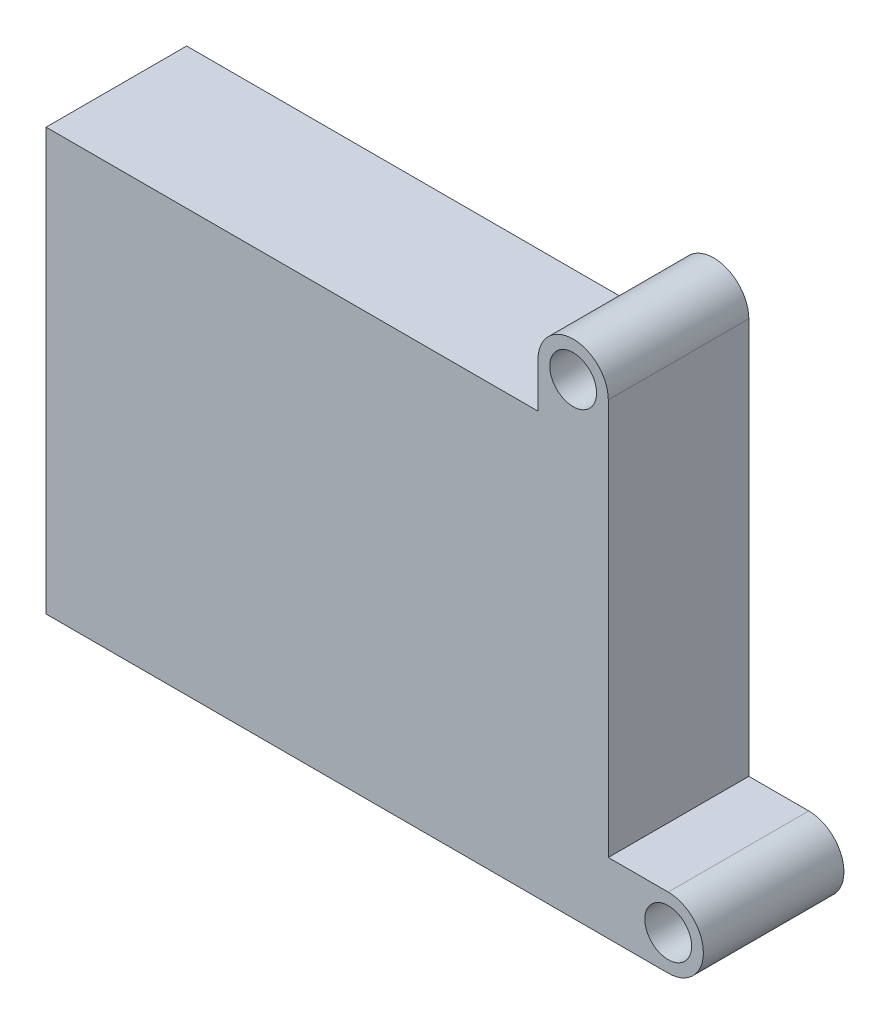
ISO-10303-21;
HEADER;
FILE_DESCRIPTION(('STEP AP214'),'2;1');
FILE_NAME('part.step','',(''),(''),'','','');
FILE_SCHEMA(('AUTOMOTIVE_DESIGN { 1 0 10303 214 1 1 1 1 }'));
ENDSEC;
DATA;
#1=APPLICATION_CONTEXT('core data for automotive mechanical design processes');
#2=APPLICATION_PROTOCOL_DEFINITION('international standard','automotive_design',2000,#1);
#3=PRODUCT_CONTEXT('',#1,'mechanical');
#4=PRODUCT('Part','Part','',(#3));
#5=PRODUCT_RELATED_PRODUCT_CATEGORY('part','',(#4));
#6=PRODUCT_DEFINITION_FORMATION('','',#4);
#7=PRODUCT_DEFINITION_CONTEXT('part definition',#1,'design');
#8=PRODUCT_DEFINITION('design','',#6,#7);
#9=PRODUCT_DEFINITION_SHAPE('','',#8);
#10=(LENGTH_UNIT() NAMED_UNIT(*) SI_UNIT(.MILLI.,.METRE.));
#11=(NAMED_UNIT(*) PLANE_ANGLE_UNIT() SI_UNIT($,.RADIAN.));
#12=(NAMED_UNIT(*) SI_UNIT($,.STERADIAN.) SOLID_ANGLE_UNIT());
#13=UNCERTAINTY_MEASURE_WITH_UNIT(LENGTH_MEASURE(1.E-05),#10,'distance_accuracy_value','');
#14=(GEOMETRIC_REPRESENTATION_CONTEXT(3) GLOBAL_UNCERTAINTY_ASSIGNED_CONTEXT((#13)) GLOBAL_UNIT_ASSIGNED_CONTEXT((#10,
#11,#12)) REPRESENTATION_CONTEXT('',''));
#15=CARTESIAN_POINT('',(0.,0.,0.));
#16=DIRECTION('',(0.,0.,1.));
#17=DIRECTION('',(1.,0.,0.));
#18=AXIS2_PLACEMENT_3D('',#15,#16,#17);
#19=CARTESIAN_POINT('',(1067.89400793056,99.4807815158164,0.));
#20=DIRECTION('',(0.,0.,1.));
#21=DIRECTION('',(-1.,0.,0.));
#22=AXIS2_PLACEMENT_3D('',#19,#20,#21);
#23=CYLINDRICAL_SURFACE('',#22,25.4);
#24=CARTESIAN_POINT('',(1067.89400793056,99.4807815158164,152.4));
#25=DIRECTION('',(0.,0.,-1.));
#26=DIRECTION('',(-1.,0.,0.));
#27=AXIS2_PLACEMENT_3D('',#24,#25,#26);
#28=CIRCLE('',#27,25.4);
#29=CARTESIAN_POINT('',(1093.29400793056,99.4807815158164,152.4));
#30=VERTEX_POINT('',#29);
#31=EDGE_CURVE('E34',#30,#30,#28,.T.);
#32=ORIENTED_EDGE('',*,*,#31,.F.);
#33=EDGE_LOOP('',(#32));
#34=FACE_BOUND('',#33,.T.);
#35=CARTESIAN_POINT('',(1067.89400793056,99.4807815158164,0.));
#36=DIRECTION('',(0.,0.,1.));
#37=DIRECTION('',(-1.,0.,0.));
#38=AXIS2_PLACEMENT_3D('',#35,#36,#37);
#39=CIRCLE('',#38,25.4);
#40=CARTESIAN_POINT('',(1093.29400793056,99.4807815158164,0.));
#41=VERTEX_POINT('',#40);
#42=EDGE_CURVE('E114',#41,#41,#39,.T.);
#43=ORIENTED_EDGE('',*,*,#42,.F.);
#44=EDGE_LOOP('',(#43));
#45=FACE_BOUND('',#44,.T.);
#46=ADVANCED_FACE('F17',(#34,#45),#23,.F.);
#47=CARTESIAN_POINT('',(1170.97600246837,-368.3,0.));
#48=DIRECTION('',(0.,0.,1.));
#49=DIRECTION('',(-1.,0.,0.));
#50=AXIS2_PLACEMENT_3D('',#47,#48,#49);
#51=CYLINDRICAL_SURFACE('',#50,25.4);
#52=CARTESIAN_POINT('',(1170.97600246837,-368.3,152.4));
#53=DIRECTION('',(0.,0.,-1.));
#54=DIRECTION('',(-1.,0.,0.));
#55=AXIS2_PLACEMENT_3D('',#52,#53,#54);
#56=CIRCLE('',#55,25.4);
#57=CARTESIAN_POINT('',(1196.37600246837,-368.3,152.4));
#58=VERTEX_POINT('',#57);
#59=EDGE_CURVE('E359',#58,#58,#56,.T.);
#60=ORIENTED_EDGE('',*,*,#59,.F.);
#61=EDGE_LOOP('',(#60));
#62=FACE_BOUND('',#61,.T.);
#63=CARTESIAN_POINT('',(1170.97600246837,-368.3,0.));
#64=DIRECTION('',(0.,0.,1.));
#65=DIRECTION('',(-1.,0.,0.));
#66=AXIS2_PLACEMENT_3D('',#63,#64,#65);
#67=CIRCLE('',#66,25.4);
#68=CARTESIAN_POINT('',(1196.37600246837,-368.3,0.));
#69=VERTEX_POINT('',#68);
#70=EDGE_CURVE('E111',#69,#69,#67,.T.);
#71=ORIENTED_EDGE('',*,*,#70,.F.);
#72=EDGE_LOOP('',(#71));
#73=FACE_BOUND('',#72,.T.);
#74=ADVANCED_FACE('F194',(#62,#73),#51,.F.);
#75=CARTESIAN_POINT('',(1029.79400793056,50.8,0.));
#76=DIRECTION('',(-1.,0.,0.));
#77=DIRECTION('',(0.,0.707106781186548,0.707106781186548));
#78=AXIS2_PLACEMENT_3D('',#75,#76,#77);
#79=PLANE('',#78);
#80=DIRECTION('',(0.,1.,0.));
#81=VECTOR('',#80,1.);
#82=CARTESIAN_POINT('',(1029.79400793056,50.8,152.4));
#83=LINE('',#82,#81);
#84=CARTESIAN_POINT('',(1029.79400793056,50.8,152.4));
#85=VERTEX_POINT('',#84);
#86=CARTESIAN_POINT('',(1029.79400793056,99.4807815158164,152.4));
#87=VERTEX_POINT('',#86);
#88=EDGE_CURVE('E11',#85,#87,#83,.T.);
#89=ORIENTED_EDGE('',*,*,#88,.T.);
#90=DIRECTION('',(0.,0.,1.));
#91=VECTOR('',#90,1.);
#92=CARTESIAN_POINT('',(1029.79400793056,99.4807815158164,0.));
#93=LINE('',#92,#91);
#94=CARTESIAN_POINT('',(1029.79400793056,99.4807815158164,0.));
#95=VERTEX_POINT('',#94);
#96=EDGE_CURVE('E123',#95,#87,#93,.T.);
#97=ORIENTED_EDGE('',*,*,#96,.F.);
#98=DIRECTION('',(0.,1.,0.));
#99=VECTOR('',#98,1.);
#100=CARTESIAN_POINT('',(1029.79400793056,50.8,0.));
#101=LINE('',#100,#99);
#102=CARTESIAN_POINT('',(1029.79400793056,50.8,0.));
#103=VERTEX_POINT('',#102);
#104=EDGE_CURVE('E112',#103,#95,#101,.T.);
#105=ORIENTED_EDGE('',*,*,#104,.F.);
#106=DIRECTION('',(0.,0.,1.));
#107=VECTOR('',#106,1.);
#108=CARTESIAN_POINT('',(1029.79400793056,50.8,0.));
#109=LINE('',#108,#107);
#110=EDGE_CURVE('E27',#103,#85,#109,.T.);
#111=ORIENTED_EDGE('',*,*,#110,.T.);
#112=EDGE_LOOP('',(#89,#97,#105,#111));
#113=FACE_BOUND('',#112,.T.);
#114=ADVANCED_FACE('F163',(#113),#79,.T.);
#115=CARTESIAN_POINT('',(1067.89400793056,99.4807815158164,0.));
#116=DIRECTION('',(0.,0.,1.));
#117=DIRECTION('',(-1.,0.,0.));
#118=AXIS2_PLACEMENT_3D('',#115,#116,#117);
#119=CYLINDRICAL_SURFACE('',#118,38.1);
#120=CARTESIAN_POINT('',(1067.89400793056,99.4807815158164,152.4));
#121=DIRECTION('',(0.,0.,-1.));
#122=DIRECTION('',(-1.,0.,0.));
#123=AXIS2_PLACEMENT_3D('',#120,#121,#122);
#124=CIRCLE('',#123,38.1);
#125=CARTESIAN_POINT('',(1105.99400793056,99.4807815158164,152.4));
#126=VERTEX_POINT('',#125);
#127=EDGE_CURVE('E125',#87,#126,#124,.T.);
#128=ORIENTED_EDGE('',*,*,#127,.T.);
#129=DIRECTION('',(0.,0.,1.));
#130=VECTOR('',#129,1.);
#131=CARTESIAN_POINT('',(1105.99400793056,99.4807815158164,0.));
#132=LINE('',#131,#130);
#133=CARTESIAN_POINT('',(1105.99400793056,99.4807815158164,0.));
#134=VERTEX_POINT('',#133);
#135=EDGE_CURVE('E128',#134,#126,#132,.T.);
#136=ORIENTED_EDGE('',*,*,#135,.F.);
#137=CARTESIAN_POINT('',(1067.89400793056,99.4807815158164,0.));
#138=DIRECTION('',(0.,0.,-1.));
#139=DIRECTION('',(-1.,0.,0.));
#140=AXIS2_PLACEMENT_3D('',#137,#138,#139);
#141=CIRCLE('',#140,38.1);
#142=EDGE_CURVE('E116',#95,#134,#141,.T.);
#143=ORIENTED_EDGE('',*,*,#142,.F.);
#144=ORIENTED_EDGE('',*,*,#96,.T.);
#145=EDGE_LOOP('',(#128,#136,#143,#144));
#146=FACE_BOUND('',#145,.T.);
#147=ADVANCED_FACE('F167',(#146),#119,.T.);
#148=CARTESIAN_POINT('',(1105.99400793056,50.8,0.));
#149=DIRECTION('',(1.,0.,0.));
#150=DIRECTION('',(0.,0.707106781186548,0.707106781186548));
#151=AXIS2_PLACEMENT_3D('',#148,#149,#150);
#152=PLANE('',#151);
#153=DIRECTION('',(0.,-1.,0.));
#154=VECTOR('',#153,1.);
#155=CARTESIAN_POINT('',(1105.99400793056,50.8,152.4));
#156=LINE('',#155,#154);
#157=CARTESIAN_POINT('',(1105.99400793056,-330.2,152.4));
#158=VERTEX_POINT('',#157);
#159=EDGE_CURVE('E129',#126,#158,#156,.T.);
#160=ORIENTED_EDGE('',*,*,#159,.T.);
#161=DIRECTION('',(0.,0.,1.));
#162=VECTOR('',#161,1.);
#163=CARTESIAN_POINT('',(1105.99400793056,-330.2,0.));
#164=LINE('',#163,#162);
#165=CARTESIAN_POINT('',(1105.99400793056,-330.2,0.));
#166=VERTEX_POINT('',#165);
#167=EDGE_CURVE('E134',#166,#158,#164,.T.);
#168=ORIENTED_EDGE('',*,*,#167,.F.);
#169=DIRECTION('',(0.,-1.,0.));
#170=VECTOR('',#169,1.);
#171=CARTESIAN_POINT('',(1105.99400793056,99.4807815158164,0.));
#172=LINE('',#171,#170);
#173=EDGE_CURVE('E119',#134,#166,#172,.T.);
#174=ORIENTED_EDGE('',*,*,#173,.F.);
#175=ORIENTED_EDGE('',*,*,#135,.T.);
#176=EDGE_LOOP('',(#160,#168,#174,#175));
#177=FACE_BOUND('',#176,.T.);
#178=ADVANCED_FACE('F173',(#177),#152,.T.);
#179=CARTESIAN_POINT('',(1105.99400793056,-330.2,0.));
#180=DIRECTION('',(0.,1.,0.));
#181=DIRECTION('',(0.707106781186548,0.,0.707106781186548));
#182=AXIS2_PLACEMENT_3D('',#179,#180,#181);
#183=PLANE('',#182);
#184=DIRECTION('',(1.,0.,0.));
#185=VECTOR('',#184,1.);
#186=CARTESIAN_POINT('',(1105.99400793056,-330.2,152.4));
#187=LINE('',#186,#185);
#188=CARTESIAN_POINT('',(1170.97600246837,-330.2,152.4));
#189=VERTEX_POINT('',#188);
#190=EDGE_CURVE('E130',#158,#189,#187,.T.);
#191=ORIENTED_EDGE('',*,*,#190,.T.);
#192=DIRECTION('',(0.,0.,1.));
#193=VECTOR('',#192,1.);
#194=CARTESIAN_POINT('',(1170.97600246837,-330.2,0.));
#195=LINE('',#194,#193);
#196=CARTESIAN_POINT('',(1170.97600246837,-330.2,0.));
#197=VERTEX_POINT('',#196);
#198=EDGE_CURVE('E141',#197,#189,#195,.T.);
#199=ORIENTED_EDGE('',*,*,#198,.F.);
#200=DIRECTION('',(1.,0.,0.));
#201=VECTOR('',#200,1.);
#202=CARTESIAN_POINT('',(1105.99400793056,-330.2,0.));
#203=LINE('',#202,#201);
#204=EDGE_CURVE('E138',#166,#197,#203,.T.);
#205=ORIENTED_EDGE('',*,*,#204,.F.);
#206=ORIENTED_EDGE('',*,*,#167,.T.);
#207=EDGE_LOOP('',(#191,#199,#205,#206));
#208=FACE_BOUND('',#207,.T.);
#209=ADVANCED_FACE('F176',(#208),#183,.T.);
#210=CARTESIAN_POINT('',(1170.97600246837,-368.3,0.));
#211=DIRECTION('',(0.,0.,1.));
#212=DIRECTION('',(0.,1.,0.));
#213=AXIS2_PLACEMENT_3D('',#210,#211,#212);
#214=CYLINDRICAL_SURFACE('',#213,38.1);
#215=CARTESIAN_POINT('',(1170.97600246837,-368.3,152.4));
#216=DIRECTION('',(0.,0.,-1.));
#217=DIRECTION('',(0.,1.,0.));
#218=AXIS2_PLACEMENT_3D('',#215,#216,#217);
#219=CIRCLE('',#218,38.1);
#220=CARTESIAN_POINT('',(1170.97600246837,-406.4,152.4));
#221=VERTEX_POINT('',#220);
#222=EDGE_CURVE('E136',#189,#221,#219,.T.);
#223=ORIENTED_EDGE('',*,*,#222,.T.);
#224=DIRECTION('',(0.,0.,1.));
#225=VECTOR('',#224,1.);
#226=CARTESIAN_POINT('',(1170.97600246837,-406.4,0.));
#227=LINE('',#226,#225);
#228=CARTESIAN_POINT('',(1170.97600246837,-406.4,0.));
#229=VERTEX_POINT('',#228);
#230=EDGE_CURVE('E148',#229,#221,#227,.T.);
#231=ORIENTED_EDGE('',*,*,#230,.F.);
#232=CARTESIAN_POINT('',(1170.97600246837,-368.3,0.));
#233=DIRECTION('',(0.,0.,-1.));
#234=DIRECTION('',(0.,1.,0.));
#235=AXIS2_PLACEMENT_3D('',#232,#233,#234);
#236=CIRCLE('',#235,38.1);
#237=EDGE_CURVE('E145',#197,#229,#236,.T.);
#238=ORIENTED_EDGE('',*,*,#237,.F.);
#239=ORIENTED_EDGE('',*,*,#198,.T.);
#240=EDGE_LOOP('',(#223,#231,#238,#239));
#241=FACE_BOUND('',#240,.T.);
#242=ADVANCED_FACE('F181',(#241),#214,.T.);
#243=CARTESIAN_POINT('',(1105.99400793056,-406.4,0.));
#244=DIRECTION('',(0.,-1.,0.));
#245=DIRECTION('',(0.707106781186548,0.,0.707106781186548));
#246=AXIS2_PLACEMENT_3D('',#243,#244,#245);
#247=PLANE('',#246);
#248=DIRECTION('',(-1.,0.,0.));
#249=VECTOR('',#248,1.);
#250=CARTESIAN_POINT('',(1105.99400793056,-406.4,152.4));
#251=LINE('',#250,#249);
#252=CARTESIAN_POINT('',(496.394007930558,-406.4,152.4));
#253=VERTEX_POINT('',#252);
#254=EDGE_CURVE('E143',#221,#253,#251,.T.);
#255=ORIENTED_EDGE('',*,*,#254,.T.);
#256=DIRECTION('',(0.,0.,1.));
#257=VECTOR('',#256,1.);
#258=CARTESIAN_POINT('',(496.394007930558,-406.4,0.));
#259=LINE('',#258,#257);
#260=CARTESIAN_POINT('',(496.394007930558,-406.4,0.));
#261=VERTEX_POINT('',#260);
#262=EDGE_CURVE('E153',#261,#253,#259,.T.);
#263=ORIENTED_EDGE('',*,*,#262,.F.);
#264=DIRECTION('',(-1.,0.,0.));
#265=VECTOR('',#264,1.);
#266=CARTESIAN_POINT('',(1170.97600246837,-406.4,0.));
#267=LINE('',#266,#265);
#268=EDGE_CURVE('E99',#229,#261,#267,.T.);
#269=ORIENTED_EDGE('',*,*,#268,.F.);
#270=ORIENTED_EDGE('',*,*,#230,.T.);
#271=EDGE_LOOP('',(#255,#263,#269,#270));
#272=FACE_BOUND('',#271,.T.);
#273=ADVANCED_FACE('F183',(#272),#247,.T.);
#274=CARTESIAN_POINT('',(496.394007930558,-406.4,0.));
#275=DIRECTION('',(-1.,0.,0.));
#276=DIRECTION('',(0.,0.707106781186548,0.707106781186548));
#277=AXIS2_PLACEMENT_3D('',#274,#275,#276);
#278=PLANE('',#277);
#279=DIRECTION('',(0.,1.,0.));
#280=VECTOR('',#279,1.);
#281=CARTESIAN_POINT('',(496.394007930558,-406.4,152.4));
#282=LINE('',#281,#280);
#283=CARTESIAN_POINT('',(496.394007930558,50.8,152.4));
#284=VERTEX_POINT('',#283);
#285=EDGE_CURVE('E105',#253,#284,#282,.T.);
#286=ORIENTED_EDGE('',*,*,#285,.T.);
#287=DIRECTION('',(0.,0.,1.));
#288=VECTOR('',#287,1.);
#289=CARTESIAN_POINT('',(496.394007930558,50.8,0.));
#290=LINE('',#289,#288);
#291=CARTESIAN_POINT('',(496.394007930558,50.8,0.));
#292=VERTEX_POINT('',#291);
#293=EDGE_CURVE('E91',#292,#284,#290,.T.);
#294=ORIENTED_EDGE('',*,*,#293,.F.);
#295=DIRECTION('',(0.,1.,0.));
#296=VECTOR('',#295,1.);
#297=CARTESIAN_POINT('',(496.394007930558,-406.4,0.));
#298=LINE('',#297,#296);
#299=EDGE_CURVE('E97',#261,#292,#298,.T.);
#300=ORIENTED_EDGE('',*,*,#299,.F.);
#301=ORIENTED_EDGE('',*,*,#262,.T.);
#302=EDGE_LOOP('',(#286,#294,#300,#301));
#303=FACE_BOUND('',#302,.T.);
#304=ADVANCED_FACE('F103',(#303),#278,.T.);
#305=CARTESIAN_POINT('',(496.394007930558,50.8,0.));
#306=DIRECTION('',(0.,1.,0.));
#307=DIRECTION('',(0.707106781186548,0.,0.707106781186548));
#308=AXIS2_PLACEMENT_3D('',#305,#306,#307);
#309=PLANE('',#308);
#310=DIRECTION('',(1.,0.,0.));
#311=VECTOR('',#310,1.);
#312=CARTESIAN_POINT('',(496.394007930558,50.8,152.4));
#313=LINE('',#312,#311);
#314=EDGE_CURVE('E107',#284,#85,#313,.T.);
#315=ORIENTED_EDGE('',*,*,#314,.T.);
#316=ORIENTED_EDGE('',*,*,#110,.F.);
#317=DIRECTION('',(1.,0.,0.));
#318=VECTOR('',#317,1.);
#319=CARTESIAN_POINT('',(496.394007930558,50.8,0.));
#320=LINE('',#319,#318);
#321=EDGE_CURVE('E21',#292,#103,#320,.T.);
#322=ORIENTED_EDGE('',*,*,#321,.F.);
#323=ORIENTED_EDGE('',*,*,#293,.T.);
#324=EDGE_LOOP('',(#315,#316,#322,#323));
#325=FACE_BOUND('',#324,.T.);
#326=ADVANCED_FACE('F110',(#325),#309,.T.);
#327=CARTESIAN_POINT('',(844.110029383577,-173.727122494433,152.4));
#328=DIRECTION('',(0.,0.,1.));
#329=DIRECTION('',(0.707106781186548,0.707106781186548,0.));
#330=AXIS2_PLACEMENT_3D('',#327,#328,#329);
#331=PLANE('',#330);
#332=ORIENTED_EDGE('',*,*,#31,.T.);
#333=EDGE_LOOP('',(#332));
#334=FACE_BOUND('',#333,.T.);
#335=ORIENTED_EDGE('',*,*,#59,.T.);
#336=EDGE_LOOP('',(#335));
#337=FACE_BOUND('',#336,.T.);
#338=ORIENTED_EDGE('',*,*,#88,.F.);
#339=ORIENTED_EDGE('',*,*,#314,.F.);
#340=ORIENTED_EDGE('',*,*,#285,.F.);
#341=ORIENTED_EDGE('',*,*,#254,.F.);
#342=ORIENTED_EDGE('',*,*,#222,.F.);
#343=ORIENTED_EDGE('',*,*,#190,.F.);
#344=ORIENTED_EDGE('',*,*,#159,.F.);
#345=ORIENTED_EDGE('',*,*,#127,.F.);
#346=EDGE_LOOP('',(#338,#339,#340,#341,#342,#343,#344,#345));
#347=FACE_BOUND('',#346,.T.);
#348=ADVANCED_FACE('F158',(#334,#337,#347),#331,.T.);
#349=CARTESIAN_POINT('',(844.110029383577,-173.727122494433,0.));
#350=DIRECTION('',(0.,0.,1.));
#351=DIRECTION('',(0.707106781186548,0.707106781186548,0.));
#352=AXIS2_PLACEMENT_3D('',#349,#350,#351);
#353=PLANE('',#352);
#354=ORIENTED_EDGE('',*,*,#42,.T.);
#355=EDGE_LOOP('',(#354));
#356=FACE_BOUND('',#355,.T.);
#357=ORIENTED_EDGE('',*,*,#70,.T.);
#358=EDGE_LOOP('',(#357));
#359=FACE_BOUND('',#358,.T.);
#360=ORIENTED_EDGE('',*,*,#321,.T.);
#361=ORIENTED_EDGE('',*,*,#104,.T.);
#362=ORIENTED_EDGE('',*,*,#142,.T.);
#363=ORIENTED_EDGE('',*,*,#173,.T.);
#364=ORIENTED_EDGE('',*,*,#204,.T.);
#365=ORIENTED_EDGE('',*,*,#237,.T.);
#366=ORIENTED_EDGE('',*,*,#268,.T.);
#367=ORIENTED_EDGE('',*,*,#299,.T.);
#368=EDGE_LOOP('',(#360,#361,#362,#363,#364,#365,#366,#367));
#369=FACE_BOUND('',#368,.T.);
#370=ADVANCED_FACE('F19',(#356,#359,#369),#353,.F.);
#371=CLOSED_SHELL('',(#46,#74,#114,#147,#178,#209,#242,#273,#304,#326,#348,#370));
#372=MANIFOLD_SOLID_BREP('B1',#371);
#373=ADVANCED_BREP_SHAPE_REPRESENTATION('',(#18,#372),#14);
#374=SHAPE_DEFINITION_REPRESENTATION(#9,#373);
ENDSEC;
END-ISO-10303-21;
